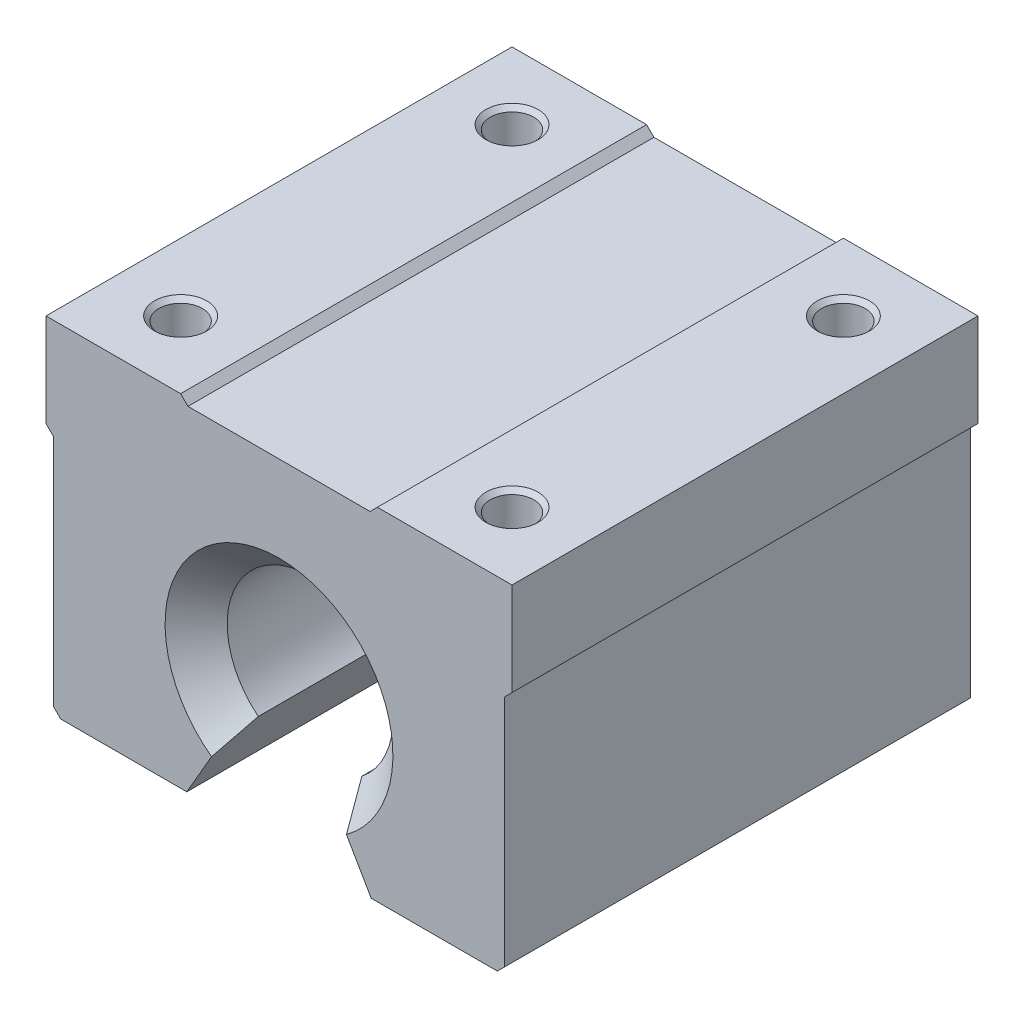
ISO-10303-21;
HEADER;
FILE_DESCRIPTION(('STEP AP214'),'2;1');
FILE_NAME('part.step','',(''),(''),'','','');
FILE_SCHEMA(('AUTOMOTIVE_DESIGN { 1 0 10303 214 1 1 1 1 }'));
ENDSEC;
DATA;
#1=APPLICATION_CONTEXT('core data for automotive mechanical design processes');
#2=APPLICATION_PROTOCOL_DEFINITION('international standard','automotive_design',2000,#1);
#3=PRODUCT_CONTEXT('',#1,'mechanical');
#4=PRODUCT('Part','Part','',(#3));
#5=PRODUCT_RELATED_PRODUCT_CATEGORY('part','',(#4));
#6=PRODUCT_DEFINITION_FORMATION('','',#4);
#7=PRODUCT_DEFINITION_CONTEXT('part definition',#1,'design');
#8=PRODUCT_DEFINITION('design','',#6,#7);
#9=PRODUCT_DEFINITION_SHAPE('','',#8);
#10=(LENGTH_UNIT() NAMED_UNIT(*) SI_UNIT(.MILLI.,.METRE.));
#11=(NAMED_UNIT(*) PLANE_ANGLE_UNIT() SI_UNIT($,.RADIAN.));
#12=(NAMED_UNIT(*) SI_UNIT($,.STERADIAN.) SOLID_ANGLE_UNIT());
#13=UNCERTAINTY_MEASURE_WITH_UNIT(LENGTH_MEASURE(1.E-05),#10,'distance_accuracy_value','');
#14=(GEOMETRIC_REPRESENTATION_CONTEXT(3) GLOBAL_UNCERTAINTY_ASSIGNED_CONTEXT((#13)) GLOBAL_UNIT_ASSIGNED_CONTEXT((#10,
#11,#12)) REPRESENTATION_CONTEXT('',''));
#15=CARTESIAN_POINT('',(0.,0.,0.));
#16=DIRECTION('',(0.,0.,1.));
#17=DIRECTION('',(1.,0.,0.));
#18=AXIS2_PLACEMENT_3D('',#15,#16,#17);
#19=CARTESIAN_POINT('',(-22.5,20.,22.5));
#20=DIRECTION('',(0.,-1.,0.));
#21=DIRECTION('',(0.,0.,-1.));
#22=AXIS2_PLACEMENT_3D('',#19,#20,#21);
#23=PLANE('',#22);
#24=CARTESIAN_POINT('',(-16.,20.,-16.));
#25=DIRECTION('',(0.,1.,0.));
#26=DIRECTION('',(0.,0.,1.));
#27=AXIS2_PLACEMENT_3D('',#24,#25,#26);
#28=CIRCLE('',#27,2.525);
#29=CARTESIAN_POINT('',(-16.,20.,-13.475));
#30=VERTEX_POINT('',#29);
#31=EDGE_CURVE('E220',#30,#30,#28,.T.);
#32=ORIENTED_EDGE('',*,*,#31,.F.);
#33=EDGE_LOOP('',(#32));
#34=FACE_BOUND('',#33,.T.);
#35=CARTESIAN_POINT('',(-16.,20.,16.));
#36=DIRECTION('',(0.,1.,0.));
#37=DIRECTION('',(0.,0.,1.));
#38=AXIS2_PLACEMENT_3D('',#35,#36,#37);
#39=CIRCLE('',#38,2.525);
#40=CARTESIAN_POINT('',(-16.,20.,18.525));
#41=VERTEX_POINT('',#40);
#42=EDGE_CURVE('E229',#41,#41,#39,.T.);
#43=ORIENTED_EDGE('',*,*,#42,.F.);
#44=EDGE_LOOP('',(#43));
#45=FACE_BOUND('',#44,.T.);
#46=DIRECTION('',(-1.,0.,0.));
#47=VECTOR('',#46,1.);
#48=CARTESIAN_POINT('',(-22.5,20.,-22.5));
#49=LINE('',#48,#47);
#50=CARTESIAN_POINT('',(-9.5,20.,-22.5));
#51=VERTEX_POINT('',#50);
#52=CARTESIAN_POINT('',(-22.5,20.,-22.5));
#53=VERTEX_POINT('',#52);
#54=EDGE_CURVE('E238',#51,#53,#49,.T.);
#55=ORIENTED_EDGE('',*,*,#54,.T.);
#56=DIRECTION('',(0.,0.,-1.));
#57=VECTOR('',#56,1.);
#58=CARTESIAN_POINT('',(-22.5,20.,22.5));
#59=LINE('',#58,#57);
#60=CARTESIAN_POINT('',(-22.5,20.,22.5));
#61=VERTEX_POINT('',#60);
#62=EDGE_CURVE('E359',#61,#53,#59,.T.);
#63=ORIENTED_EDGE('',*,*,#62,.F.);
#64=DIRECTION('',(-1.,0.,0.));
#65=VECTOR('',#64,1.);
#66=CARTESIAN_POINT('',(-22.5,20.,22.5));
#67=LINE('',#66,#65);
#68=CARTESIAN_POINT('',(-9.5,20.,22.5));
#69=VERTEX_POINT('',#68);
#70=EDGE_CURVE('E239',#69,#61,#67,.T.);
#71=ORIENTED_EDGE('',*,*,#70,.F.);
#72=DIRECTION('',(0.,0.,-1.));
#73=VECTOR('',#72,1.);
#74=CARTESIAN_POINT('',(-9.5,20.,22.5));
#75=LINE('',#74,#73);
#76=EDGE_CURVE('E275',#69,#51,#75,.T.);
#77=ORIENTED_EDGE('',*,*,#76,.T.);
#78=EDGE_LOOP('',(#55,#63,#71,#77));
#79=FACE_BOUND('',#78,.T.);
#80=ADVANCED_FACE('F41',(#34,#45,#79),#23,.F.);
#81=CARTESIAN_POINT('',(-22.5,20.,22.5));
#82=DIRECTION('',(1.,0.,0.));
#83=DIRECTION('',(0.,0.,-1.));
#84=AXIS2_PLACEMENT_3D('',#81,#82,#83);
#85=PLANE('',#84);
#86=DIRECTION('',(0.,-1.,0.));
#87=VECTOR('',#86,1.);
#88=CARTESIAN_POINT('',(-22.5,20.,-22.5));
#89=LINE('',#88,#87);
#90=CARTESIAN_POINT('',(-22.5,11.,-22.5));
#91=VERTEX_POINT('',#90);
#92=EDGE_CURVE('E278',#53,#91,#89,.T.);
#93=ORIENTED_EDGE('',*,*,#92,.T.);
#94=DIRECTION('',(0.,0.,-1.));
#95=VECTOR('',#94,1.);
#96=CARTESIAN_POINT('',(-22.5,11.,22.5));
#97=LINE('',#96,#95);
#98=CARTESIAN_POINT('',(-22.5,11.,22.5));
#99=VERTEX_POINT('',#98);
#100=EDGE_CURVE('E356',#99,#91,#97,.T.);
#101=ORIENTED_EDGE('',*,*,#100,.F.);
#102=DIRECTION('',(0.,-1.,0.));
#103=VECTOR('',#102,1.);
#104=CARTESIAN_POINT('',(-22.5,20.,22.5));
#105=LINE('',#104,#103);
#106=EDGE_CURVE('E242',#61,#99,#105,.T.);
#107=ORIENTED_EDGE('',*,*,#106,.F.);
#108=ORIENTED_EDGE('',*,*,#62,.T.);
#109=EDGE_LOOP('',(#93,#101,#107,#108));
#110=FACE_BOUND('',#109,.T.);
#111=ADVANCED_FACE('F421',(#110),#85,.F.);
#112=CARTESIAN_POINT('',(-22.5,11.,22.5));
#113=DIRECTION('',(0.707106781186546,0.707106781186549,0.));
#114=DIRECTION('',(-0.707106781186549,0.707106781186546,0.));
#115=AXIS2_PLACEMENT_3D('',#112,#113,#114);
#116=PLANE('',#115);
#117=DIRECTION('',(0.707106781186549,-0.707106781186546,0.));
#118=VECTOR('',#117,1.);
#119=CARTESIAN_POINT('',(-22.5,11.,-22.5));
#120=LINE('',#119,#118);
#121=CARTESIAN_POINT('',(-21.7928932188135,10.2928932188135,-22.5));
#122=VERTEX_POINT('',#121);
#123=EDGE_CURVE('E280',#91,#122,#120,.T.);
#124=ORIENTED_EDGE('',*,*,#123,.T.);
#125=DIRECTION('',(0.,0.,-1.));
#126=VECTOR('',#125,1.);
#127=CARTESIAN_POINT('',(-21.7928932188135,10.2928932188135,22.5));
#128=LINE('',#127,#126);
#129=CARTESIAN_POINT('',(-21.7928932188135,10.2928932188135,22.5));
#130=VERTEX_POINT('',#129);
#131=EDGE_CURVE('E353',#130,#122,#128,.T.);
#132=ORIENTED_EDGE('',*,*,#131,.F.);
#133=DIRECTION('',(0.707106781186549,-0.707106781186546,0.));
#134=VECTOR('',#133,1.);
#135=CARTESIAN_POINT('',(-22.5,11.,22.5));
#136=LINE('',#135,#134);
#137=EDGE_CURVE('E245',#99,#130,#136,.T.);
#138=ORIENTED_EDGE('',*,*,#137,.F.);
#139=ORIENTED_EDGE('',*,*,#100,.T.);
#140=EDGE_LOOP('',(#124,#132,#138,#139));
#141=FACE_BOUND('',#140,.T.);
#142=ADVANCED_FACE('F425',(#141),#116,.F.);
#143=CARTESIAN_POINT('',(-21.7928932188135,10.2928932188135,22.5));
#144=DIRECTION('',(1.,0.,0.));
#145=DIRECTION('',(0.,1.,0.));
#146=AXIS2_PLACEMENT_3D('',#143,#144,#145);
#147=PLANE('',#146);
#148=DIRECTION('',(0.,-1.,0.));
#149=VECTOR('',#148,1.);
#150=CARTESIAN_POINT('',(-21.7928932188135,10.2928932188135,-22.5));
#151=LINE('',#150,#149);
#152=CARTESIAN_POINT('',(-21.7928932188134,-12.2928932188135,-22.5));
#153=VERTEX_POINT('',#152);
#154=EDGE_CURVE('E282',#122,#153,#151,.T.);
#155=ORIENTED_EDGE('',*,*,#154,.T.);
#156=DIRECTION('',(0.,0.,-1.));
#157=VECTOR('',#156,1.);
#158=CARTESIAN_POINT('',(-21.7928932188134,-12.2928932188135,22.5));
#159=LINE('',#158,#157);
#160=CARTESIAN_POINT('',(-21.7928932188134,-12.2928932188135,22.5));
#161=VERTEX_POINT('',#160);
#162=EDGE_CURVE('E350',#161,#153,#159,.T.);
#163=ORIENTED_EDGE('',*,*,#162,.F.);
#164=DIRECTION('',(0.,-1.,0.));
#165=VECTOR('',#164,1.);
#166=CARTESIAN_POINT('',(-21.7928932188135,10.2928932188135,22.5));
#167=LINE('',#166,#165);
#168=EDGE_CURVE('E247',#130,#161,#167,.T.);
#169=ORIENTED_EDGE('',*,*,#168,.F.);
#170=ORIENTED_EDGE('',*,*,#131,.T.);
#171=EDGE_LOOP('',(#155,#163,#169,#170));
#172=FACE_BOUND('',#171,.T.);
#173=ADVANCED_FACE('F429',(#172),#147,.F.);
#174=CARTESIAN_POINT('',(-21.7928932188134,-12.2928932188135,22.5));
#175=DIRECTION('',(0.707106781186542,0.707106781186553,0.));
#176=DIRECTION('',(-0.707106781186553,0.707106781186542,0.));
#177=AXIS2_PLACEMENT_3D('',#174,#175,#176);
#178=PLANE('',#177);
#179=DIRECTION('',(0.707106781186553,-0.707106781186542,0.));
#180=VECTOR('',#179,1.);
#181=CARTESIAN_POINT('',(-21.7928932188134,-12.2928932188135,-22.5));
#182=LINE('',#181,#180);
#183=CARTESIAN_POINT('',(-21.0857864376269,-13.,-22.5));
#184=VERTEX_POINT('',#183);
#185=EDGE_CURVE('E284',#153,#184,#182,.T.);
#186=ORIENTED_EDGE('',*,*,#185,.T.);
#187=DIRECTION('',(0.,0.,-1.));
#188=VECTOR('',#187,1.);
#189=CARTESIAN_POINT('',(-21.0857864376269,-13.,22.5));
#190=LINE('',#189,#188);
#191=CARTESIAN_POINT('',(-21.0857864376269,-13.,22.5));
#192=VERTEX_POINT('',#191);
#193=EDGE_CURVE('E347',#192,#184,#190,.T.);
#194=ORIENTED_EDGE('',*,*,#193,.F.);
#195=DIRECTION('',(0.707106781186553,-0.707106781186542,0.));
#196=VECTOR('',#195,1.);
#197=CARTESIAN_POINT('',(-21.7928932188134,-12.2928932188135,22.5));
#198=LINE('',#197,#196);
#199=EDGE_CURVE('E249',#161,#192,#198,.T.);
#200=ORIENTED_EDGE('',*,*,#199,.F.);
#201=ORIENTED_EDGE('',*,*,#162,.T.);
#202=EDGE_LOOP('',(#186,#194,#200,#201));
#203=FACE_BOUND('',#202,.T.);
#204=ADVANCED_FACE('F432',(#203),#178,.F.);
#205=CARTESIAN_POINT('',(-21.0857864376269,-13.,22.5));
#206=DIRECTION('',(0.,1.,0.));
#207=DIRECTION('',(-1.,0.,0.));
#208=AXIS2_PLACEMENT_3D('',#205,#206,#207);
#209=PLANE('',#208);
#210=DIRECTION('',(1.,0.,0.));
#211=VECTOR('',#210,1.);
#212=CARTESIAN_POINT('',(-21.0857864376269,-13.,-22.5));
#213=LINE('',#212,#211);
#214=CARTESIAN_POINT('',(-8.90000222400116,-13.,-22.5));
#215=VERTEX_POINT('',#214);
#216=EDGE_CURVE('E286',#184,#215,#213,.T.);
#217=ORIENTED_EDGE('',*,*,#216,.T.);
#218=DIRECTION('',(0.,0.,-1.));
#219=VECTOR('',#218,1.);
#220=CARTESIAN_POINT('',(-8.90000222400116,-13.,22.5));
#221=LINE('',#220,#219);
#222=CARTESIAN_POINT('',(-8.90000222400116,-13.,22.5));
#223=VERTEX_POINT('',#222);
#224=EDGE_CURVE('E344',#223,#215,#221,.T.);
#225=ORIENTED_EDGE('',*,*,#224,.F.);
#226=DIRECTION('',(1.,0.,0.));
#227=VECTOR('',#226,1.);
#228=CARTESIAN_POINT('',(-21.0857864376269,-13.,22.5));
#229=LINE('',#228,#227);
#230=EDGE_CURVE('E251',#192,#223,#229,.T.);
#231=ORIENTED_EDGE('',*,*,#230,.F.);
#232=ORIENTED_EDGE('',*,*,#193,.T.);
#233=EDGE_LOOP('',(#217,#225,#231,#232));
#234=FACE_BOUND('',#233,.T.);
#235=ADVANCED_FACE('F397',(#234),#209,.F.);
#236=CARTESIAN_POINT('',(-8.90000222400116,-13.,22.5));
#237=DIRECTION('',(-0.866025403784438,0.500000000000001,0.));
#238=DIRECTION('',(-0.500000000000001,-0.866025403784438,0.));
#239=AXIS2_PLACEMENT_3D('',#236,#237,#238);
#240=PLANE('',#239);
#241=DIRECTION('',(0.500000000000001,0.866025403784438,0.));
#242=VECTOR('',#241,1.);
#243=CARTESIAN_POINT('',(-8.90000222400116,-13.,-22.5));
#244=LINE('',#243,#242);
#245=CARTESIAN_POINT('',(-6.51259139811201,-8.86488315102003,-22.5));
#246=VERTEX_POINT('',#245);
#247=EDGE_CURVE('E288',#215,#246,#244,.T.);
#248=ORIENTED_EDGE('',*,*,#247,.T.);
#249=CARTESIAN_POINT('',(-6.51259139811201,-8.86488315102003,-22.5));
#250=CARTESIAN_POINT('',(-6.38668504007308,-8.64680694190066,-22.2497118828855));
#251=CARTESIAN_POINT('',(-6.26075386517851,-8.42868774872641,-21.9994736753837));
#252=CARTESIAN_POINT('',(-6.00882674626239,-7.99233717895925,-21.4991279368277));
#253=CARTESIAN_POINT('',(-5.88283080226974,-7.77410580241637,-21.2490204057154));
#254=CARTESIAN_POINT('',(-5.63075887329718,-7.33750441427402,-20.7489666059144));
#255=CARTESIAN_POINT('',(-5.50468288830189,-7.11913440264788,-20.4990203372568));
#256=CARTESIAN_POINT('',(-5.25242616501369,-6.68221294136187,-19.999339119979));
#257=CARTESIAN_POINT('',(-5.12624542667377,-6.46366149162057,-19.7496041714537));
#258=CARTESIAN_POINT('',(-5.,-6.2449979983984,-19.5));
#259=B_SPLINE_CURVE_WITH_KNOTS('',3,(#249,#250,#251,#252,#253,#254,#255,#256,#257,#258),
.UNSPECIFIED.,.F.,.F.,(4,2,2,2,4),(0.,1.06512164089084,2.13024280709936,3.19536417823267,
4.26048602769983),.UNSPECIFIED.);
#260=CARTESIAN_POINT('',(-5.,-6.2449979983984,-19.4999999999999));
#261=VERTEX_POINT('',#260);
#262=EDGE_CURVE('E51',#246,#261,#259,.T.);
#263=ORIENTED_EDGE('',*,*,#262,.T.);
#264=DIRECTION('',(0.,0.,-1.));
#265=VECTOR('',#264,1.);
#266=CARTESIAN_POINT('',(-5.,-6.2449979983984,22.5));
#267=LINE('',#266,#265);
#268=CARTESIAN_POINT('',(-5.,-6.2449979983984,19.5));
#269=VERTEX_POINT('',#268);
#270=EDGE_CURVE('E341',#269,#261,#267,.T.);
#271=ORIENTED_EDGE('',*,*,#270,.F.);
#272=CARTESIAN_POINT('',(-5.,-6.2449979983984,19.5));
#273=CARTESIAN_POINT('',(-5.12624542667376,-6.46366149162056,19.7496041714537));
#274=CARTESIAN_POINT('',(-5.25242616501368,-6.68221294136186,19.999339119979));
#275=CARTESIAN_POINT('',(-5.50468288830188,-7.11913440264785,20.4990203372568));
#276=CARTESIAN_POINT('',(-5.63075887329716,-7.33750441427398,20.7489666059144));
#277=CARTESIAN_POINT('',(-5.88283080226971,-7.77410580241632,21.2490204057154));
#278=CARTESIAN_POINT('',(-6.00882674626236,-7.99233717895919,21.4991279368278));
#279=CARTESIAN_POINT('',(-6.26075386517847,-8.42868774872634,21.9994736753837));
#280=CARTESIAN_POINT('',(-6.38668504007304,-8.64680694190058,22.2497118828855));
#281=CARTESIAN_POINT('',(-6.51259139811196,-8.86488315101994,22.5));
#282=B_SPLINE_CURVE_WITH_KNOTS('',3,(#272,#273,#274,#275,#276,#277,#278,#279,#280,#281),
.UNSPECIFIED.,.F.,.F.,(4,2,2,2,4),(0.,1.06512184946713,2.13024322060042,3.1953643868089,
4.26048602769971),.UNSPECIFIED.);
#283=CARTESIAN_POINT('',(-6.51259139811196,-8.86488315101994,22.5));
#284=VERTEX_POINT('',#283);
#285=EDGE_CURVE('E58',#269,#284,#282,.T.);
#286=ORIENTED_EDGE('',*,*,#285,.T.);
#287=DIRECTION('',(0.500000000000001,0.866025403784438,0.));
#288=VECTOR('',#287,1.);
#289=CARTESIAN_POINT('',(-8.90000222400116,-13.,22.5));
#290=LINE('',#289,#288);
#291=EDGE_CURVE('E253',#223,#284,#290,.T.);
#292=ORIENTED_EDGE('',*,*,#291,.F.);
#293=ORIENTED_EDGE('',*,*,#224,.T.);
#294=EDGE_LOOP('',(#248,#263,#271,#286,#292,#293));
#295=FACE_BOUND('',#294,.T.);
#296=ADVANCED_FACE('F392',(#295),#240,.F.);
#297=CARTESIAN_POINT('',(0.,0.,22.5));
#298=DIRECTION('',(0.,0.,-1.));
#299=DIRECTION('',(-1.,0.,0.));
#300=AXIS2_PLACEMENT_3D('',#297,#298,#299);
#301=CYLINDRICAL_SURFACE('',#300,8.);
#302=ORIENTED_EDGE('',*,*,#270,.T.);
#303=CARTESIAN_POINT('',(0.,0.,-19.5));
#304=DIRECTION('',(0.,0.,1.));
#305=DIRECTION('',(1.,0.,0.));
#306=AXIS2_PLACEMENT_3D('',#303,#304,#305);
#307=CIRCLE('',#306,8.);
#308=CARTESIAN_POINT('',(5.,-6.2449979983984,-19.4999999999999));
#309=VERTEX_POINT('',#308);
#310=EDGE_CURVE('E364',#261,#309,#307,.F.);
#311=ORIENTED_EDGE('',*,*,#310,.T.);
#312=DIRECTION('',(0.,0.,-1.));
#313=VECTOR('',#312,1.);
#314=CARTESIAN_POINT('',(5.,-6.2449979983984,22.5));
#315=LINE('',#314,#313);
#316=CARTESIAN_POINT('',(5.,-6.2449979983984,19.5));
#317=VERTEX_POINT('',#316);
#318=EDGE_CURVE('E338',#317,#309,#315,.T.);
#319=ORIENTED_EDGE('',*,*,#318,.F.);
#320=CARTESIAN_POINT('',(0.,0.,19.5));
#321=DIRECTION('',(0.,0.,1.));
#322=DIRECTION('',(1.,0.,0.));
#323=AXIS2_PLACEMENT_3D('',#320,#321,#322);
#324=CIRCLE('',#323,8.);
#325=EDGE_CURVE('E362',#317,#269,#324,.T.);
#326=ORIENTED_EDGE('',*,*,#325,.T.);
#327=EDGE_LOOP('',(#302,#311,#319,#326));
#328=FACE_BOUND('',#327,.T.);
#329=ADVANCED_FACE('F386',(#328),#301,.F.);
#330=CARTESIAN_POINT('',(8.90000222400116,-13.,22.5));
#331=DIRECTION('',(0.866025403784438,0.500000000000001,0.));
#332=DIRECTION('',(-0.500000000000001,0.866025403784438,0.));
#333=AXIS2_PLACEMENT_3D('',#330,#331,#332);
#334=PLANE('',#333);
#335=ORIENTED_EDGE('',*,*,#318,.T.);
#336=CARTESIAN_POINT('',(5.,-6.2449979983984,-19.5));
#337=CARTESIAN_POINT('',(5.12624542667376,-6.46366149162057,-19.7496041714537));
#338=CARTESIAN_POINT('',(5.25242616501369,-6.68221294136187,-19.999339119979));
#339=CARTESIAN_POINT('',(5.50468288830189,-7.11913440264788,-20.4990203372568));
#340=CARTESIAN_POINT('',(5.63075887329718,-7.33750441427402,-20.7489666059144));
#341=CARTESIAN_POINT('',(5.88283080226974,-7.77410580241637,-21.2490204057154));
#342=CARTESIAN_POINT('',(6.00882674626239,-7.99233717895925,-21.4991279368277));
#343=CARTESIAN_POINT('',(6.26075386517851,-8.42868774872641,-21.9994736753837));
#344=CARTESIAN_POINT('',(6.38668504007309,-8.64680694190066,-22.2497118828855));
#345=CARTESIAN_POINT('',(6.51259139811201,-8.86488315102003,-22.5));
#346=B_SPLINE_CURVE_WITH_KNOTS('',3,(#336,#337,#338,#339,#340,#341,#342,#343,#344,#345),
.UNSPECIFIED.,.F.,.F.,(4,2,2,2,4),(0.,1.06512184946717,2.13024322060048,3.19536438680899,
4.26048602769984),.UNSPECIFIED.);
#347=CARTESIAN_POINT('',(6.51259139811201,-8.86488315102003,-22.5));
#348=VERTEX_POINT('',#347);
#349=EDGE_CURVE('E374',#309,#348,#346,.T.);
#350=ORIENTED_EDGE('',*,*,#349,.T.);
#351=DIRECTION('',(0.500000000000001,-0.866025403784438,0.));
#352=VECTOR('',#351,1.);
#353=CARTESIAN_POINT('',(8.90000222400116,-13.,-22.5));
#354=LINE('',#353,#352);
#355=CARTESIAN_POINT('',(8.90000222400116,-13.,-22.5));
#356=VERTEX_POINT('',#355);
#357=EDGE_CURVE('E290',#348,#356,#354,.T.);
#358=ORIENTED_EDGE('',*,*,#357,.T.);
#359=DIRECTION('',(0.,0.,-1.));
#360=VECTOR('',#359,1.);
#361=CARTESIAN_POINT('',(8.90000222400116,-13.,22.5));
#362=LINE('',#361,#360);
#363=CARTESIAN_POINT('',(8.90000222400116,-13.,22.5));
#364=VERTEX_POINT('',#363);
#365=EDGE_CURVE('E335',#364,#356,#362,.T.);
#366=ORIENTED_EDGE('',*,*,#365,.F.);
#367=DIRECTION('',(0.500000000000001,-0.866025403784438,0.));
#368=VECTOR('',#367,1.);
#369=CARTESIAN_POINT('',(8.90000222400116,-13.,22.5));
#370=LINE('',#369,#368);
#371=CARTESIAN_POINT('',(6.51259139811196,-8.86488315101994,22.5));
#372=VERTEX_POINT('',#371);
#373=EDGE_CURVE('E255',#372,#364,#370,.T.);
#374=ORIENTED_EDGE('',*,*,#373,.F.);
#375=CARTESIAN_POINT('',(6.51259139811196,-8.86488315101994,22.5));
#376=CARTESIAN_POINT('',(6.38668504007304,-8.64680694190058,22.2497118828855));
#377=CARTESIAN_POINT('',(6.26075386517847,-8.42868774872634,21.9994736753837));
#378=CARTESIAN_POINT('',(6.00882674626236,-7.99233717895919,21.4991279368278));
#379=CARTESIAN_POINT('',(5.88283080226971,-7.77410580241632,21.2490204057154));
#380=CARTESIAN_POINT('',(5.63075887329716,-7.33750441427398,20.7489666059144));
#381=CARTESIAN_POINT('',(5.50468288830187,-7.11913440264785,20.4990203372568));
#382=CARTESIAN_POINT('',(5.25242616501368,-6.68221294136186,19.999339119979));
#383=CARTESIAN_POINT('',(5.12624542667376,-6.46366149162056,19.7496041714537));
#384=CARTESIAN_POINT('',(5.,-6.2449979983984,19.5));
#385=B_SPLINE_CURVE_WITH_KNOTS('',3,(#375,#376,#377,#378,#379,#380,#381,#382,#383,#384),
.UNSPECIFIED.,.F.,.F.,(4,2,2,2,4),(0.,1.06512164089081,2.1302428070993,3.19536417823258,
4.26048602769971),.UNSPECIFIED.);
#386=EDGE_CURVE('E367',#372,#317,#385,.T.);
#387=ORIENTED_EDGE('',*,*,#386,.T.);
#388=EDGE_LOOP('',(#335,#350,#358,#366,#374,#387));
#389=FACE_BOUND('',#388,.T.);
#390=ADVANCED_FACE('F380',(#389),#334,.F.);
#391=CARTESIAN_POINT('',(21.0857864376269,-13.,22.5));
#392=DIRECTION('',(0.,1.,0.));
#393=DIRECTION('',(-1.,0.,0.));
#394=AXIS2_PLACEMENT_3D('',#391,#392,#393);
#395=PLANE('',#394);
#396=DIRECTION('',(1.,0.,0.));
#397=VECTOR('',#396,1.);
#398=CARTESIAN_POINT('',(21.0857864376269,-13.,-22.5));
#399=LINE('',#398,#397);
#400=CARTESIAN_POINT('',(21.0857864376269,-13.,-22.5));
#401=VERTEX_POINT('',#400);
#402=EDGE_CURVE('E292',#356,#401,#399,.T.);
#403=ORIENTED_EDGE('',*,*,#402,.T.);
#404=DIRECTION('',(0.,0.,-1.));
#405=VECTOR('',#404,1.);
#406=CARTESIAN_POINT('',(21.0857864376269,-13.,22.5));
#407=LINE('',#406,#405);
#408=CARTESIAN_POINT('',(21.0857864376269,-13.,22.5));
#409=VERTEX_POINT('',#408);
#410=EDGE_CURVE('E332',#409,#401,#407,.T.);
#411=ORIENTED_EDGE('',*,*,#410,.F.);
#412=DIRECTION('',(1.,0.,0.));
#413=VECTOR('',#412,1.);
#414=CARTESIAN_POINT('',(21.0857864376269,-13.,22.5));
#415=LINE('',#414,#413);
#416=EDGE_CURVE('E257',#364,#409,#415,.T.);
#417=ORIENTED_EDGE('',*,*,#416,.F.);
#418=ORIENTED_EDGE('',*,*,#365,.T.);
#419=EDGE_LOOP('',(#403,#411,#417,#418));
#420=FACE_BOUND('',#419,.T.);
#421=ADVANCED_FACE('F385',(#420),#395,.F.);
#422=CARTESIAN_POINT('',(21.7928932188134,-12.2928932188135,22.5));
#423=DIRECTION('',(-0.707106781186544,0.707106781186551,0.));
#424=DIRECTION('',(-0.707106781186551,-0.707106781186544,0.));
#425=AXIS2_PLACEMENT_3D('',#422,#423,#424);
#426=PLANE('',#425);
#427=DIRECTION('',(0.707106781186551,0.707106781186544,0.));
#428=VECTOR('',#427,1.);
#429=CARTESIAN_POINT('',(21.7928932188134,-12.2928932188135,-22.5));
#430=LINE('',#429,#428);
#431=CARTESIAN_POINT('',(21.7928932188134,-12.2928932188135,-22.5));
#432=VERTEX_POINT('',#431);
#433=EDGE_CURVE('E294',#401,#432,#430,.T.);
#434=ORIENTED_EDGE('',*,*,#433,.T.);
#435=DIRECTION('',(0.,0.,-1.));
#436=VECTOR('',#435,1.);
#437=CARTESIAN_POINT('',(21.7928932188134,-12.2928932188135,22.5));
#438=LINE('',#437,#436);
#439=CARTESIAN_POINT('',(21.7928932188134,-12.2928932188135,22.5));
#440=VERTEX_POINT('',#439);
#441=EDGE_CURVE('E329',#440,#432,#438,.T.);
#442=ORIENTED_EDGE('',*,*,#441,.F.);
#443=DIRECTION('',(0.707106781186551,0.707106781186544,0.));
#444=VECTOR('',#443,1.);
#445=CARTESIAN_POINT('',(21.7928932188134,-12.2928932188135,22.5));
#446=LINE('',#445,#444);
#447=EDGE_CURVE('E259',#409,#440,#446,.T.);
#448=ORIENTED_EDGE('',*,*,#447,.F.);
#449=ORIENTED_EDGE('',*,*,#410,.T.);
#450=EDGE_LOOP('',(#434,#442,#448,#449));
#451=FACE_BOUND('',#450,.T.);
#452=ADVANCED_FACE('F508',(#451),#426,.F.);
#453=CARTESIAN_POINT('',(21.7928932188135,10.2928932188135,22.5));
#454=DIRECTION('',(-1.,0.,0.));
#455=DIRECTION('',(0.,-1.,0.));
#456=AXIS2_PLACEMENT_3D('',#453,#454,#455);
#457=PLANE('',#456);
#458=DIRECTION('',(0.,1.,0.));
#459=VECTOR('',#458,1.);
#460=CARTESIAN_POINT('',(21.7928932188135,10.2928932188135,-22.5));
#461=LINE('',#460,#459);
#462=CARTESIAN_POINT('',(21.7928932188135,10.2928932188135,-22.5));
#463=VERTEX_POINT('',#462);
#464=EDGE_CURVE('E296',#432,#463,#461,.T.);
#465=ORIENTED_EDGE('',*,*,#464,.T.);
#466=DIRECTION('',(0.,0.,-1.));
#467=VECTOR('',#466,1.);
#468=CARTESIAN_POINT('',(21.7928932188135,10.2928932188135,22.5));
#469=LINE('',#468,#467);
#470=CARTESIAN_POINT('',(21.7928932188135,10.2928932188135,22.5));
#471=VERTEX_POINT('',#470);
#472=EDGE_CURVE('E326',#471,#463,#469,.T.);
#473=ORIENTED_EDGE('',*,*,#472,.F.);
#474=DIRECTION('',(0.,1.,0.));
#475=VECTOR('',#474,1.);
#476=CARTESIAN_POINT('',(21.7928932188135,10.2928932188135,22.5));
#477=LINE('',#476,#475);
#478=EDGE_CURVE('E261',#440,#471,#477,.T.);
#479=ORIENTED_EDGE('',*,*,#478,.F.);
#480=ORIENTED_EDGE('',*,*,#441,.T.);
#481=EDGE_LOOP('',(#465,#473,#479,#480));
#482=FACE_BOUND('',#481,.T.);
#483=ADVANCED_FACE('F503',(#482),#457,.F.);
#484=CARTESIAN_POINT('',(22.5,11.,22.5));
#485=DIRECTION('',(-0.707106781186546,0.707106781186549,0.));
#486=DIRECTION('',(-0.707106781186549,-0.707106781186546,0.));
#487=AXIS2_PLACEMENT_3D('',#484,#485,#486);
#488=PLANE('',#487);
#489=DIRECTION('',(0.707106781186549,0.707106781186546,0.));
#490=VECTOR('',#489,1.);
#491=CARTESIAN_POINT('',(22.5,11.,-22.5));
#492=LINE('',#491,#490);
#493=CARTESIAN_POINT('',(22.5,11.,-22.5));
#494=VERTEX_POINT('',#493);
#495=EDGE_CURVE('E298',#463,#494,#492,.T.);
#496=ORIENTED_EDGE('',*,*,#495,.T.);
#497=DIRECTION('',(0.,0.,-1.));
#498=VECTOR('',#497,1.);
#499=CARTESIAN_POINT('',(22.5,11.,22.5));
#500=LINE('',#499,#498);
#501=CARTESIAN_POINT('',(22.5,11.,22.5));
#502=VERTEX_POINT('',#501);
#503=EDGE_CURVE('E323',#502,#494,#500,.T.);
#504=ORIENTED_EDGE('',*,*,#503,.F.);
#505=DIRECTION('',(0.707106781186549,0.707106781186546,0.));
#506=VECTOR('',#505,1.);
#507=CARTESIAN_POINT('',(22.5,11.,22.5));
#508=LINE('',#507,#506);
#509=EDGE_CURVE('E263',#471,#502,#508,.T.);
#510=ORIENTED_EDGE('',*,*,#509,.F.);
#511=ORIENTED_EDGE('',*,*,#472,.T.);
#512=EDGE_LOOP('',(#496,#504,#510,#511));
#513=FACE_BOUND('',#512,.T.);
#514=ADVANCED_FACE('F497',(#513),#488,.F.);
#515=CARTESIAN_POINT('',(22.5,20.,22.5));
#516=DIRECTION('',(-1.,0.,0.));
#517=DIRECTION('',(0.,0.,1.));
#518=AXIS2_PLACEMENT_3D('',#515,#516,#517);
#519=PLANE('',#518);
#520=DIRECTION('',(0.,1.,0.));
#521=VECTOR('',#520,1.);
#522=CARTESIAN_POINT('',(22.5,20.,-22.5));
#523=LINE('',#522,#521);
#524=CARTESIAN_POINT('',(22.5,20.,-22.5));
#525=VERTEX_POINT('',#524);
#526=EDGE_CURVE('E300',#494,#525,#523,.T.);
#527=ORIENTED_EDGE('',*,*,#526,.T.);
#528=DIRECTION('',(0.,0.,-1.));
#529=VECTOR('',#528,1.);
#530=CARTESIAN_POINT('',(22.5,20.,22.5));
#531=LINE('',#530,#529);
#532=CARTESIAN_POINT('',(22.5,20.,22.5));
#533=VERTEX_POINT('',#532);
#534=EDGE_CURVE('E320',#533,#525,#531,.T.);
#535=ORIENTED_EDGE('',*,*,#534,.F.);
#536=DIRECTION('',(0.,1.,0.));
#537=VECTOR('',#536,1.);
#538=CARTESIAN_POINT('',(22.5,20.,22.5));
#539=LINE('',#538,#537);
#540=EDGE_CURVE('E265',#502,#533,#539,.T.);
#541=ORIENTED_EDGE('',*,*,#540,.F.);
#542=ORIENTED_EDGE('',*,*,#503,.T.);
#543=EDGE_LOOP('',(#527,#535,#541,#542));
#544=FACE_BOUND('',#543,.T.);
#545=ADVANCED_FACE('F493',(#544),#519,.F.);
#546=CARTESIAN_POINT('',(22.5,20.,22.5));
#547=DIRECTION('',(0.,-1.,0.));
#548=DIRECTION('',(0.,0.,-1.));
#549=AXIS2_PLACEMENT_3D('',#546,#547,#548);
#550=PLANE('',#549);
#551=CARTESIAN_POINT('',(16.,20.,16.));
#552=DIRECTION('',(0.,1.,0.));
#553=DIRECTION('',(0.,0.,1.));
#554=AXIS2_PLACEMENT_3D('',#551,#552,#553);
#555=CIRCLE('',#554,2.525);
#556=CARTESIAN_POINT('',(16.,20.,18.525));
#557=VERTEX_POINT('',#556);
#558=EDGE_CURVE('E211',#557,#557,#555,.T.);
#559=ORIENTED_EDGE('',*,*,#558,.F.);
#560=EDGE_LOOP('',(#559));
#561=FACE_BOUND('',#560,.T.);
#562=CARTESIAN_POINT('',(16.,20.,-16.));
#563=DIRECTION('',(0.,1.,0.));
#564=DIRECTION('',(0.,0.,1.));
#565=AXIS2_PLACEMENT_3D('',#562,#563,#564);
#566=CIRCLE('',#565,2.525);
#567=CARTESIAN_POINT('',(16.,20.,-13.475));
#568=VERTEX_POINT('',#567);
#569=EDGE_CURVE('E204',#568,#568,#566,.T.);
#570=ORIENTED_EDGE('',*,*,#569,.F.);
#571=EDGE_LOOP('',(#570));
#572=FACE_BOUND('',#571,.T.);
#573=DIRECTION('',(-1.,0.,0.));
#574=VECTOR('',#573,1.);
#575=CARTESIAN_POINT('',(22.5,20.,-22.5));
#576=LINE('',#575,#574);
#577=CARTESIAN_POINT('',(9.5,20.,-22.5));
#578=VERTEX_POINT('',#577);
#579=EDGE_CURVE('E302',#525,#578,#576,.T.);
#580=ORIENTED_EDGE('',*,*,#579,.T.);
#581=DIRECTION('',(0.,0.,-1.));
#582=VECTOR('',#581,1.);
#583=CARTESIAN_POINT('',(9.5,20.,22.5));
#584=LINE('',#583,#582);
#585=CARTESIAN_POINT('',(9.5,20.,22.5));
#586=VERTEX_POINT('',#585);
#587=EDGE_CURVE('E317',#586,#578,#584,.T.);
#588=ORIENTED_EDGE('',*,*,#587,.F.);
#589=DIRECTION('',(-1.,0.,0.));
#590=VECTOR('',#589,1.);
#591=CARTESIAN_POINT('',(22.5,20.,22.5));
#592=LINE('',#591,#590);
#593=EDGE_CURVE('E267',#533,#586,#592,.T.);
#594=ORIENTED_EDGE('',*,*,#593,.F.);
#595=ORIENTED_EDGE('',*,*,#534,.T.);
#596=EDGE_LOOP('',(#580,#588,#594,#595));
#597=FACE_BOUND('',#596,.T.);
#598=ADVANCED_FACE('F488',(#561,#572,#597),#550,.F.);
#599=CARTESIAN_POINT('',(9.5,20.,22.5));
#600=DIRECTION('',(0.707106781186547,-0.707106781186548,0.));
#601=DIRECTION('',(0.707106781186548,0.707106781186547,0.));
#602=AXIS2_PLACEMENT_3D('',#599,#600,#601);
#603=PLANE('',#602);
#604=DIRECTION('',(-0.707106781186548,-0.707106781186547,0.));
#605=VECTOR('',#604,1.);
#606=CARTESIAN_POINT('',(9.5,20.,-22.5));
#607=LINE('',#606,#605);
#608=CARTESIAN_POINT('',(8.79289321881345,19.2928932188134,-22.5));
#609=VERTEX_POINT('',#608);
#610=EDGE_CURVE('E304',#578,#609,#607,.T.);
#611=ORIENTED_EDGE('',*,*,#610,.T.);
#612=DIRECTION('',(0.,0.,-1.));
#613=VECTOR('',#612,1.);
#614=CARTESIAN_POINT('',(8.79289321881345,19.2928932188134,22.5));
#615=LINE('',#614,#613);
#616=CARTESIAN_POINT('',(8.79289321881345,19.2928932188134,22.5));
#617=VERTEX_POINT('',#616);
#618=EDGE_CURVE('E314',#617,#609,#615,.T.);
#619=ORIENTED_EDGE('',*,*,#618,.F.);
#620=DIRECTION('',(-0.707106781186548,-0.707106781186547,0.));
#621=VECTOR('',#620,1.);
#622=CARTESIAN_POINT('',(9.5,20.,22.5));
#623=LINE('',#622,#621);
#624=EDGE_CURVE('E269',#586,#617,#623,.T.);
#625=ORIENTED_EDGE('',*,*,#624,.F.);
#626=ORIENTED_EDGE('',*,*,#587,.T.);
#627=EDGE_LOOP('',(#611,#619,#625,#626));
#628=FACE_BOUND('',#627,.T.);
#629=ADVANCED_FACE('F482',(#628),#603,.F.);
#630=CARTESIAN_POINT('',(-8.79289321881345,19.2928932188134,22.5));
#631=DIRECTION('',(0.,-1.,0.));
#632=DIRECTION('',(0.,0.,-1.));
#633=AXIS2_PLACEMENT_3D('',#630,#631,#632);
#634=PLANE('',#633);
#635=DIRECTION('',(-1.,0.,0.));
#636=VECTOR('',#635,1.);
#637=CARTESIAN_POINT('',(-8.79289321881345,19.2928932188134,-22.5));
#638=LINE('',#637,#636);
#639=CARTESIAN_POINT('',(-8.79289321881345,19.2928932188134,-22.5));
#640=VERTEX_POINT('',#639);
#641=EDGE_CURVE('E306',#609,#640,#638,.T.);
#642=ORIENTED_EDGE('',*,*,#641,.T.);
#643=DIRECTION('',(0.,0.,-1.));
#644=VECTOR('',#643,1.);
#645=CARTESIAN_POINT('',(-8.79289321881345,19.2928932188134,22.5));
#646=LINE('',#645,#644);
#647=CARTESIAN_POINT('',(-8.79289321881345,19.2928932188134,22.5));
#648=VERTEX_POINT('',#647);
#649=EDGE_CURVE('E311',#648,#640,#646,.T.);
#650=ORIENTED_EDGE('',*,*,#649,.F.);
#651=DIRECTION('',(-1.,0.,0.));
#652=VECTOR('',#651,1.);
#653=CARTESIAN_POINT('',(-8.79289321881345,19.2928932188134,22.5));
#654=LINE('',#653,#652);
#655=EDGE_CURVE('E271',#617,#648,#654,.T.);
#656=ORIENTED_EDGE('',*,*,#655,.F.);
#657=ORIENTED_EDGE('',*,*,#618,.T.);
#658=EDGE_LOOP('',(#642,#650,#656,#657));
#659=FACE_BOUND('',#658,.T.);
#660=ADVANCED_FACE('F478',(#659),#634,.F.);
#661=CARTESIAN_POINT('',(-9.5,20.,22.5));
#662=DIRECTION('',(-0.707106781186547,-0.707106781186548,0.));
#663=DIRECTION('',(0.707106781186548,-0.707106781186547,0.));
#664=AXIS2_PLACEMENT_3D('',#661,#662,#663);
#665=PLANE('',#664);
#666=DIRECTION('',(-0.707106781186548,0.707106781186547,0.));
#667=VECTOR('',#666,1.);
#668=CARTESIAN_POINT('',(-9.5,20.,-22.5));
#669=LINE('',#668,#667);
#670=EDGE_CURVE('E243',#640,#51,#669,.T.);
#671=ORIENTED_EDGE('',*,*,#670,.T.);
#672=ORIENTED_EDGE('',*,*,#76,.F.);
#673=DIRECTION('',(-0.707106781186548,0.707106781186547,0.));
#674=VECTOR('',#673,1.);
#675=CARTESIAN_POINT('',(-9.5,20.,22.5));
#676=LINE('',#675,#674);
#677=EDGE_CURVE('E273',#648,#69,#676,.T.);
#678=ORIENTED_EDGE('',*,*,#677,.F.);
#679=ORIENTED_EDGE('',*,*,#649,.T.);
#680=EDGE_LOOP('',(#671,#672,#678,#679));
#681=FACE_BOUND('',#680,.T.);
#682=ADVANCED_FACE('F473',(#681),#665,.F.);
#683=CARTESIAN_POINT('',(0.,0.,22.5));
#684=DIRECTION('',(0.,0.,1.));
#685=DIRECTION('',(1.,0.,0.));
#686=AXIS2_PLACEMENT_3D('',#683,#684,#685);
#687=PLANE('',#686);
#688=ORIENTED_EDGE('',*,*,#291,.T.);
#689=CARTESIAN_POINT('',(0.,0.,22.5));
#690=DIRECTION('',(0.,0.,1.));
#691=DIRECTION('',(1.,0.,0.));
#692=AXIS2_PLACEMENT_3D('',#689,#690,#691);
#693=CIRCLE('',#692,11.);
#694=EDGE_CURVE('E11',#284,#372,#693,.F.);
#695=ORIENTED_EDGE('',*,*,#694,.T.);
#696=ORIENTED_EDGE('',*,*,#373,.T.);
#697=ORIENTED_EDGE('',*,*,#416,.T.);
#698=ORIENTED_EDGE('',*,*,#447,.T.);
#699=ORIENTED_EDGE('',*,*,#478,.T.);
#700=ORIENTED_EDGE('',*,*,#509,.T.);
#701=ORIENTED_EDGE('',*,*,#540,.T.);
#702=ORIENTED_EDGE('',*,*,#593,.T.);
#703=ORIENTED_EDGE('',*,*,#624,.T.);
#704=ORIENTED_EDGE('',*,*,#655,.T.);
#705=ORIENTED_EDGE('',*,*,#677,.T.);
#706=ORIENTED_EDGE('',*,*,#70,.T.);
#707=ORIENTED_EDGE('',*,*,#106,.T.);
#708=ORIENTED_EDGE('',*,*,#137,.T.);
#709=ORIENTED_EDGE('',*,*,#168,.T.);
#710=ORIENTED_EDGE('',*,*,#199,.T.);
#711=ORIENTED_EDGE('',*,*,#230,.T.);
#712=EDGE_LOOP('',(#688,#695,#696,#697,#698,#699,#700,#701,#702,#703,#704,#705,#706,#707,#708,
#709,#710,#711));
#713=FACE_BOUND('',#712,.T.);
#714=ADVANCED_FACE('F458',(#713),#687,.T.);
#715=CARTESIAN_POINT('',(0.,0.,-22.5));
#716=DIRECTION('',(0.,0.,1.));
#717=DIRECTION('',(1.,0.,0.));
#718=AXIS2_PLACEMENT_3D('',#715,#716,#717);
#719=PLANE('',#718);
#720=ORIENTED_EDGE('',*,*,#357,.F.);
#721=CARTESIAN_POINT('',(0.,0.,-22.5));
#722=DIRECTION('',(0.,0.,1.));
#723=DIRECTION('',(1.,0.,0.));
#724=AXIS2_PLACEMENT_3D('',#721,#722,#723);
#725=CIRCLE('',#724,11.0000000000001);
#726=EDGE_CURVE('E66',#348,#246,#725,.T.);
#727=ORIENTED_EDGE('',*,*,#726,.T.);
#728=ORIENTED_EDGE('',*,*,#247,.F.);
#729=ORIENTED_EDGE('',*,*,#216,.F.);
#730=ORIENTED_EDGE('',*,*,#185,.F.);
#731=ORIENTED_EDGE('',*,*,#154,.F.);
#732=ORIENTED_EDGE('',*,*,#123,.F.);
#733=ORIENTED_EDGE('',*,*,#92,.F.);
#734=ORIENTED_EDGE('',*,*,#54,.F.);
#735=ORIENTED_EDGE('',*,*,#670,.F.);
#736=ORIENTED_EDGE('',*,*,#641,.F.);
#737=ORIENTED_EDGE('',*,*,#610,.F.);
#738=ORIENTED_EDGE('',*,*,#579,.F.);
#739=ORIENTED_EDGE('',*,*,#526,.F.);
#740=ORIENTED_EDGE('',*,*,#495,.F.);
#741=ORIENTED_EDGE('',*,*,#464,.F.);
#742=ORIENTED_EDGE('',*,*,#433,.F.);
#743=ORIENTED_EDGE('',*,*,#402,.F.);
#744=EDGE_LOOP('',(#720,#727,#728,#729,#730,#731,#732,#733,#734,#735,#736,#737,#738,#739,#740,
#741,#742,#743));
#745=FACE_BOUND('',#744,.T.);
#746=ADVANCED_FACE('F448',(#745),#719,.F.);
#747=CARTESIAN_POINT('',(-16.,7.99999859999998,16.));
#748=DIRECTION('',(0.,1.,0.));
#749=DIRECTION('',(0.,0.,1.));
#750=AXIS2_PLACEMENT_3D('',#747,#748,#749);
#751=CONICAL_SURFACE('',#750,2.09999999999996,1.02974425867665);
#752=CARTESIAN_POINT('',(-16.,6.73819130004212,16.));
#753=VERTEX_POINT('',#752);
#754=VERTEX_LOOP('',#753);
#755=FACE_BOUND('',#754,.T.);
#756=CARTESIAN_POINT('',(-16.,7.99999859999998,16.));
#757=DIRECTION('',(0.,1.,0.));
#758=DIRECTION('',(0.,0.,1.));
#759=AXIS2_PLACEMENT_3D('',#756,#757,#758);
#760=CIRCLE('',#759,2.09999999999996);
#761=CARTESIAN_POINT('',(-16.,7.99999859999998,18.1));
#762=VERTEX_POINT('',#761);
#763=EDGE_CURVE('E235',#762,#762,#760,.T.);
#764=ORIENTED_EDGE('',*,*,#763,.T.);
#765=EDGE_LOOP('',(#764));
#766=FACE_BOUND('',#765,.T.);
#767=ADVANCED_FACE('F536',(#755,#766),#751,.F.);
#768=CARTESIAN_POINT('',(-16.,20.,16.));
#769=DIRECTION('',(0.,1.,0.));
#770=DIRECTION('',(0.,0.,1.));
#771=AXIS2_PLACEMENT_3D('',#768,#769,#770);
#772=CYLINDRICAL_SURFACE('',#771,2.09999999999998);
#773=ORIENTED_EDGE('',*,*,#763,.F.);
#774=EDGE_LOOP('',(#773));
#775=FACE_BOUND('',#774,.T.);
#776=CARTESIAN_POINT('',(-16.,19.575,16.));
#777=DIRECTION('',(0.,1.,0.));
#778=DIRECTION('',(0.,0.,1.));
#779=AXIS2_PLACEMENT_3D('',#776,#777,#778);
#780=CIRCLE('',#779,2.1);
#781=CARTESIAN_POINT('',(-16.,19.575,18.1));
#782=VERTEX_POINT('',#781);
#783=EDGE_CURVE('E232',#782,#782,#780,.T.);
#784=ORIENTED_EDGE('',*,*,#783,.T.);
#785=EDGE_LOOP('',(#784));
#786=FACE_BOUND('',#785,.T.);
#787=ADVANCED_FACE('F541',(#775,#786),#772,.F.);
#788=CARTESIAN_POINT('',(-16.,20.,16.));
#789=DIRECTION('',(0.,1.,0.));
#790=DIRECTION('',(0.,0.,1.));
#791=AXIS2_PLACEMENT_3D('',#788,#789,#790);
#792=CONICAL_SURFACE('',#791,2.525,0.785398163397442);
#793=ORIENTED_EDGE('',*,*,#783,.F.);
#794=EDGE_LOOP('',(#793));
#795=FACE_BOUND('',#794,.T.);
#796=ORIENTED_EDGE('',*,*,#42,.T.);
#797=EDGE_LOOP('',(#796));
#798=FACE_BOUND('',#797,.T.);
#799=ADVANCED_FACE('F545',(#795,#798),#792,.F.);
#800=CARTESIAN_POINT('',(-16.,7.99999859999998,-16.));
#801=DIRECTION('',(0.,1.,0.));
#802=DIRECTION('',(0.,0.,1.));
#803=AXIS2_PLACEMENT_3D('',#800,#801,#802);
#804=CONICAL_SURFACE('',#803,2.09999999999996,1.02974425867665);
#805=CARTESIAN_POINT('',(-16.,6.73819130004212,-16.));
#806=VERTEX_POINT('',#805);
#807=VERTEX_LOOP('',#806);
#808=FACE_BOUND('',#807,.T.);
#809=CARTESIAN_POINT('',(-16.,7.99999859999998,-16.));
#810=DIRECTION('',(0.,1.,0.));
#811=DIRECTION('',(0.,0.,1.));
#812=AXIS2_PLACEMENT_3D('',#809,#810,#811);
#813=CIRCLE('',#812,2.09999999999996);
#814=CARTESIAN_POINT('',(-16.,7.99999859999998,-13.9));
#815=VERTEX_POINT('',#814);
#816=EDGE_CURVE('E226',#815,#815,#813,.T.);
#817=ORIENTED_EDGE('',*,*,#816,.T.);
#818=EDGE_LOOP('',(#817));
#819=FACE_BOUND('',#818,.T.);
#820=ADVANCED_FACE('F549',(#808,#819),#804,.F.);
#821=CARTESIAN_POINT('',(-16.,20.,-16.));
#822=DIRECTION('',(0.,1.,0.));
#823=DIRECTION('',(0.,0.,1.));
#824=AXIS2_PLACEMENT_3D('',#821,#822,#823);
#825=CYLINDRICAL_SURFACE('',#824,2.09999999999998);
#826=ORIENTED_EDGE('',*,*,#816,.F.);
#827=EDGE_LOOP('',(#826));
#828=FACE_BOUND('',#827,.T.);
#829=CARTESIAN_POINT('',(-16.,19.575,-16.));
#830=DIRECTION('',(0.,1.,0.));
#831=DIRECTION('',(0.,0.,1.));
#832=AXIS2_PLACEMENT_3D('',#829,#830,#831);
#833=CIRCLE('',#832,2.1);
#834=CARTESIAN_POINT('',(-16.,19.575,-13.9));
#835=VERTEX_POINT('',#834);
#836=EDGE_CURVE('E223',#835,#835,#833,.T.);
#837=ORIENTED_EDGE('',*,*,#836,.T.);
#838=EDGE_LOOP('',(#837));
#839=FACE_BOUND('',#838,.T.);
#840=ADVANCED_FACE('F553',(#828,#839),#825,.F.);
#841=CARTESIAN_POINT('',(-16.,20.,-16.));
#842=DIRECTION('',(0.,1.,0.));
#843=DIRECTION('',(0.,0.,1.));
#844=AXIS2_PLACEMENT_3D('',#841,#842,#843);
#845=CONICAL_SURFACE('',#844,2.525,0.785398163397442);
#846=ORIENTED_EDGE('',*,*,#836,.F.);
#847=EDGE_LOOP('',(#846));
#848=FACE_BOUND('',#847,.T.);
#849=ORIENTED_EDGE('',*,*,#31,.T.);
#850=EDGE_LOOP('',(#849));
#851=FACE_BOUND('',#850,.T.);
#852=ADVANCED_FACE('F557',(#848,#851),#845,.F.);
#853=CARTESIAN_POINT('',(16.,7.99999860000001,-16.));
#854=DIRECTION('',(0.,1.,0.));
#855=DIRECTION('',(0.,0.,1.));
#856=AXIS2_PLACEMENT_3D('',#853,#854,#855);
#857=CONICAL_SURFACE('',#856,2.09999999999996,1.02974425867665);
#858=CARTESIAN_POINT('',(16.,6.73819130004215,-16.));
#859=VERTEX_POINT('',#858);
#860=VERTEX_LOOP('',#859);
#861=FACE_BOUND('',#860,.T.);
#862=CARTESIAN_POINT('',(16.,7.99999860000001,-16.));
#863=DIRECTION('',(0.,1.,0.));
#864=DIRECTION('',(0.,0.,1.));
#865=AXIS2_PLACEMENT_3D('',#862,#863,#864);
#866=CIRCLE('',#865,2.09999999999996);
#867=CARTESIAN_POINT('',(16.,7.99999860000001,-13.9));
#868=VERTEX_POINT('',#867);
#869=EDGE_CURVE('E217',#868,#868,#866,.T.);
#870=ORIENTED_EDGE('',*,*,#869,.T.);
#871=EDGE_LOOP('',(#870));
#872=FACE_BOUND('',#871,.T.);
#873=ADVANCED_FACE('F561',(#861,#872),#857,.F.);
#874=CARTESIAN_POINT('',(16.,20.,-16.));
#875=DIRECTION('',(0.,1.,0.));
#876=DIRECTION('',(0.,0.,1.));
#877=AXIS2_PLACEMENT_3D('',#874,#875,#876);
#878=CYLINDRICAL_SURFACE('',#877,2.09999999999998);
#879=ORIENTED_EDGE('',*,*,#869,.F.);
#880=EDGE_LOOP('',(#879));
#881=FACE_BOUND('',#880,.T.);
#882=CARTESIAN_POINT('',(16.,19.575,-16.));
#883=DIRECTION('',(0.,1.,0.));
#884=DIRECTION('',(0.,0.,1.));
#885=AXIS2_PLACEMENT_3D('',#882,#883,#884);
#886=CIRCLE('',#885,2.1);
#887=CARTESIAN_POINT('',(16.,19.575,-13.9));
#888=VERTEX_POINT('',#887);
#889=EDGE_CURVE('E208',#888,#888,#886,.T.);
#890=ORIENTED_EDGE('',*,*,#889,.T.);
#891=EDGE_LOOP('',(#890));
#892=FACE_BOUND('',#891,.T.);
#893=ADVANCED_FACE('F565',(#881,#892),#878,.F.);
#894=CARTESIAN_POINT('',(16.,20.,-16.));
#895=DIRECTION('',(0.,1.,0.));
#896=DIRECTION('',(0.,0.,1.));
#897=AXIS2_PLACEMENT_3D('',#894,#895,#896);
#898=CONICAL_SURFACE('',#897,2.525,0.785398163397444);
#899=ORIENTED_EDGE('',*,*,#889,.F.);
#900=EDGE_LOOP('',(#899));
#901=FACE_BOUND('',#900,.T.);
#902=ORIENTED_EDGE('',*,*,#569,.T.);
#903=EDGE_LOOP('',(#902));
#904=FACE_BOUND('',#903,.T.);
#905=ADVANCED_FACE('F198',(#901,#904),#898,.F.);
#906=CARTESIAN_POINT('',(16.,7.99999860000001,16.));
#907=DIRECTION('',(0.,1.,0.));
#908=DIRECTION('',(0.,0.,1.));
#909=AXIS2_PLACEMENT_3D('',#906,#907,#908);
#910=CONICAL_SURFACE('',#909,2.09999999999996,1.02974425867665);
#911=CARTESIAN_POINT('',(16.,6.73819130004215,16.));
#912=VERTEX_POINT('',#911);
#913=VERTEX_LOOP('',#912);
#914=FACE_BOUND('',#913,.T.);
#915=CARTESIAN_POINT('',(16.,7.99999860000001,16.));
#916=DIRECTION('',(0.,1.,0.));
#917=DIRECTION('',(0.,0.,1.));
#918=AXIS2_PLACEMENT_3D('',#915,#916,#917);
#919=CIRCLE('',#918,2.09999999999996);
#920=CARTESIAN_POINT('',(16.,7.99999860000001,18.1));
#921=VERTEX_POINT('',#920);
#922=EDGE_CURVE('E202',#921,#921,#919,.T.);
#923=ORIENTED_EDGE('',*,*,#922,.T.);
#924=EDGE_LOOP('',(#923));
#925=FACE_BOUND('',#924,.T.);
#926=ADVANCED_FACE('F194',(#914,#925),#910,.F.);
#927=CARTESIAN_POINT('',(16.,20.,16.));
#928=DIRECTION('',(0.,1.,0.));
#929=DIRECTION('',(0.,0.,1.));
#930=AXIS2_PLACEMENT_3D('',#927,#928,#929);
#931=CYLINDRICAL_SURFACE('',#930,2.09999999999998);
#932=ORIENTED_EDGE('',*,*,#922,.F.);
#933=EDGE_LOOP('',(#932));
#934=FACE_BOUND('',#933,.T.);
#935=CARTESIAN_POINT('',(16.,19.575,16.));
#936=DIRECTION('',(0.,1.,0.));
#937=DIRECTION('',(0.,0.,1.));
#938=AXIS2_PLACEMENT_3D('',#935,#936,#937);
#939=CIRCLE('',#938,2.1);
#940=CARTESIAN_POINT('',(16.,19.575,18.1));
#941=VERTEX_POINT('',#940);
#942=EDGE_CURVE('E205',#941,#941,#939,.T.);
#943=ORIENTED_EDGE('',*,*,#942,.T.);
#944=EDGE_LOOP('',(#943));
#945=FACE_BOUND('',#944,.T.);
#946=ADVANCED_FACE('F197',(#934,#945),#931,.F.);
#947=CARTESIAN_POINT('',(16.,20.,16.));
#948=DIRECTION('',(0.,1.,0.));
#949=DIRECTION('',(0.,0.,1.));
#950=AXIS2_PLACEMENT_3D('',#947,#948,#949);
#951=CONICAL_SURFACE('',#950,2.525,0.785398163397444);
#952=ORIENTED_EDGE('',*,*,#942,.F.);
#953=EDGE_LOOP('',(#952));
#954=FACE_BOUND('',#953,.T.);
#955=ORIENTED_EDGE('',*,*,#558,.T.);
#956=EDGE_LOOP('',(#955));
#957=FACE_BOUND('',#956,.T.);
#958=ADVANCED_FACE('F416',(#954,#957),#951,.F.);
#959=CARTESIAN_POINT('',(0.,0.,-19.5));
#960=DIRECTION('',(0.,0.,-1.));
#961=DIRECTION('',(-1.,0.,0.));
#962=AXIS2_PLACEMENT_3D('',#959,#960,#961);
#963=CONICAL_SURFACE('',#962,8.,0.78539816339745);
#964=ORIENTED_EDGE('',*,*,#262,.F.);
#965=ORIENTED_EDGE('',*,*,#726,.F.);
#966=ORIENTED_EDGE('',*,*,#349,.F.);
#967=ORIENTED_EDGE('',*,*,#310,.F.);
#968=EDGE_LOOP('',(#964,#965,#966,#967));
#969=FACE_BOUND('',#968,.T.);
#970=ADVANCED_FACE('F410',(#969),#963,.F.);
#971=CARTESIAN_POINT('',(0.,0.,22.5));
#972=DIRECTION('',(0.,0.,1.));
#973=DIRECTION('',(1.,0.,0.));
#974=AXIS2_PLACEMENT_3D('',#971,#972,#973);
#975=CONICAL_SURFACE('',#974,11.,0.785398163397446);
#976=ORIENTED_EDGE('',*,*,#285,.F.);
#977=ORIENTED_EDGE('',*,*,#325,.F.);
#978=ORIENTED_EDGE('',*,*,#386,.F.);
#979=ORIENTED_EDGE('',*,*,#694,.F.);
#980=EDGE_LOOP('',(#976,#977,#978,#979));
#981=FACE_BOUND('',#980,.T.);
#982=ADVANCED_FACE('F44',(#981),#975,.F.);
#983=CLOSED_SHELL('',(#80,#111,#142,#173,#204,#235,#296,#329,#390,#421,#452,#483,#514,#545,#598,
#629,#660,#682,#714,#746,#767,#787,#799,#820,#840,#852,#873,#893,#905,#926,#946,#958,#970,#982));
#984=MANIFOLD_SOLID_BREP('B2',#983);
#985=ADVANCED_BREP_SHAPE_REPRESENTATION('',(#18,#984),#14);
#986=SHAPE_DEFINITION_REPRESENTATION(#9,#985);
ENDSEC;
END-ISO-10303-21;
